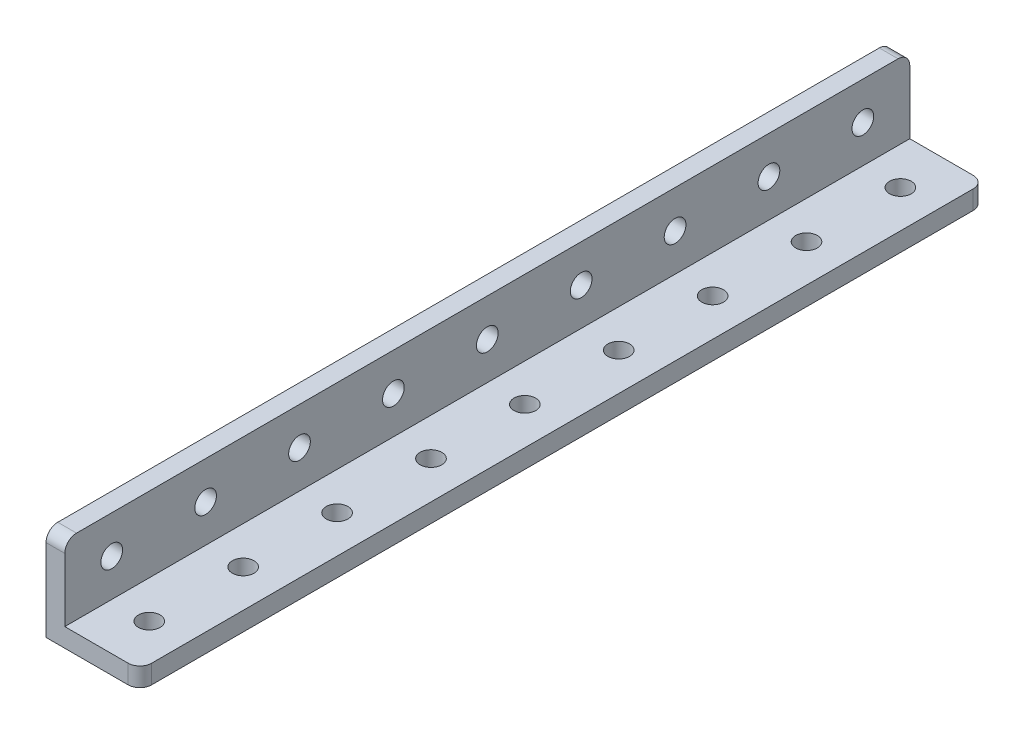
ISO-10303-21;
HEADER;
FILE_DESCRIPTION(('STEP AP214'),'2;1');
FILE_NAME('part.step','',(''),(''),'','','');
FILE_SCHEMA(('AUTOMOTIVE_DESIGN { 1 0 10303 214 1 1 1 1 }'));
ENDSEC;
DATA;
#1=APPLICATION_CONTEXT('core data for automotive mechanical design processes');
#2=APPLICATION_PROTOCOL_DEFINITION('international standard','automotive_design',2000,#1);
#3=PRODUCT_CONTEXT('',#1,'mechanical');
#4=PRODUCT('Part','Part','',(#3));
#5=PRODUCT_RELATED_PRODUCT_CATEGORY('part','',(#4));
#6=PRODUCT_DEFINITION_FORMATION('','',#4);
#7=PRODUCT_DEFINITION_CONTEXT('part definition',#1,'design');
#8=PRODUCT_DEFINITION('design','',#6,#7);
#9=PRODUCT_DEFINITION_SHAPE('','',#8);
#10=(LENGTH_UNIT() NAMED_UNIT(*) SI_UNIT(.MILLI.,.METRE.));
#11=(NAMED_UNIT(*) PLANE_ANGLE_UNIT() SI_UNIT($,.RADIAN.));
#12=(NAMED_UNIT(*) SI_UNIT($,.STERADIAN.) SOLID_ANGLE_UNIT());
#13=UNCERTAINTY_MEASURE_WITH_UNIT(LENGTH_MEASURE(1.E-05),#10,'distance_accuracy_value','');
#14=(GEOMETRIC_REPRESENTATION_CONTEXT(3) GLOBAL_UNCERTAINTY_ASSIGNED_CONTEXT((#13)) GLOBAL_UNIT_ASSIGNED_CONTEXT((#10,
#11,#12)) REPRESENTATION_CONTEXT('',''));
#15=CARTESIAN_POINT('',(0.,0.,0.));
#16=DIRECTION('',(0.,0.,1.));
#17=DIRECTION('',(1.,0.,0.));
#18=AXIS2_PLACEMENT_3D('',#15,#16,#17);
#19=CARTESIAN_POINT('',(14.,36.8576,-142.));
#20=DIRECTION('',(0.,-1.,0.));
#21=DIRECTION('',(0.,0.,-1.));
#22=AXIS2_PLACEMENT_3D('',#19,#20,#21);
#23=CYLINDRICAL_SURFACE('',#22,2.);
#24=CARTESIAN_POINT('',(14.,3.2,-142.));
#25=DIRECTION('',(0.,-1.,0.));
#26=DIRECTION('',(0.,0.,-1.));
#27=AXIS2_PLACEMENT_3D('',#24,#25,#26);
#28=CIRCLE('',#27,2.);
#29=CARTESIAN_POINT('',(16.,3.2,-142.));
#30=VERTEX_POINT('',#29);
#31=CARTESIAN_POINT('',(14.,3.2,-144.));
#32=VERTEX_POINT('',#31);
#33=EDGE_CURVE('E21',#30,#32,#28,.F.);
#34=ORIENTED_EDGE('',*,*,#33,.F.);
#35=DIRECTION('',(0.,1.,0.));
#36=VECTOR('',#35,1.);
#37=CARTESIAN_POINT('',(16.,0.,-142.));
#38=LINE('',#37,#36);
#39=CARTESIAN_POINT('',(16.,0.,-142.));
#40=VERTEX_POINT('',#39);
#41=EDGE_CURVE('E86',#40,#30,#38,.T.);
#42=ORIENTED_EDGE('',*,*,#41,.F.);
#43=CARTESIAN_POINT('',(14.,0.,-142.));
#44=DIRECTION('',(0.,-1.,0.));
#45=DIRECTION('',(0.,0.,-1.));
#46=AXIS2_PLACEMENT_3D('',#43,#44,#45);
#47=CIRCLE('',#46,2.);
#48=CARTESIAN_POINT('',(14.,0.,-144.));
#49=VERTEX_POINT('',#48);
#50=EDGE_CURVE('E227',#49,#40,#47,.T.);
#51=ORIENTED_EDGE('',*,*,#50,.F.);
#52=DIRECTION('',(0.,1.,0.));
#53=VECTOR('',#52,1.);
#54=CARTESIAN_POINT('',(14.,0.,-144.));
#55=LINE('',#54,#53);
#56=EDGE_CURVE('E89',#49,#32,#55,.T.);
#57=ORIENTED_EDGE('',*,*,#56,.T.);
#58=EDGE_LOOP('',(#34,#42,#51,#57));
#59=FACE_BOUND('',#58,.T.);
#60=ADVANCED_FACE('F18',(#59),#23,.T.);
#61=CARTESIAN_POINT('',(16.,0.,0.));
#62=DIRECTION('',(1.,0.,0.));
#63=DIRECTION('',(0.,0.,-1.));
#64=AXIS2_PLACEMENT_3D('',#61,#62,#63);
#65=PLANE('',#64);
#66=DIRECTION('',(0.,1.,0.));
#67=VECTOR('',#66,1.);
#68=CARTESIAN_POINT('',(16.,-20.8576,-2.));
#69=LINE('',#68,#67);
#70=CARTESIAN_POINT('',(16.,0.,-2.));
#71=VERTEX_POINT('',#70);
#72=CARTESIAN_POINT('',(16.,3.2,-2.));
#73=VERTEX_POINT('',#72);
#74=EDGE_CURVE('E95',#71,#73,#69,.T.);
#75=ORIENTED_EDGE('',*,*,#74,.F.);
#76=DIRECTION('',(0.,0.,-1.));
#77=VECTOR('',#76,1.);
#78=CARTESIAN_POINT('',(16.,0.,0.));
#79=LINE('',#78,#77);
#80=EDGE_CURVE('E102',#40,#71,#79,.F.);
#81=ORIENTED_EDGE('',*,*,#80,.F.);
#82=ORIENTED_EDGE('',*,*,#41,.T.);
#83=DIRECTION('',(0.,0.,1.));
#84=VECTOR('',#83,1.);
#85=CARTESIAN_POINT('',(16.,3.2,0.));
#86=LINE('',#85,#84);
#87=EDGE_CURVE('E99',#73,#30,#86,.F.);
#88=ORIENTED_EDGE('',*,*,#87,.F.);
#89=EDGE_LOOP('',(#75,#81,#82,#88));
#90=FACE_BOUND('',#89,.T.);
#91=ADVANCED_FACE('F98',(#90),#65,.T.);
#92=CARTESIAN_POINT('',(9.6,3.2,-8.));
#93=DIRECTION('',(0.,-1.,0.));
#94=DIRECTION('',(0.,0.,-1.));
#95=AXIS2_PLACEMENT_3D('',#92,#93,#94);
#96=CYLINDRICAL_SURFACE('',#95,1.85);
#97=CARTESIAN_POINT('',(9.6,3.2,-8.));
#98=DIRECTION('',(0.,-1.,0.));
#99=DIRECTION('',(0.,0.,-1.));
#100=AXIS2_PLACEMENT_3D('',#97,#98,#99);
#101=CIRCLE('',#100,1.85);
#102=CARTESIAN_POINT('',(9.6,3.2,-9.85));
#103=VERTEX_POINT('',#102);
#104=EDGE_CURVE('E107',#103,#103,#101,.T.);
#105=ORIENTED_EDGE('',*,*,#104,.F.);
#106=EDGE_LOOP('',(#105));
#107=FACE_BOUND('',#106,.T.);
#108=CARTESIAN_POINT('',(9.6,0.,-8.));
#109=DIRECTION('',(0.,-1.,0.));
#110=DIRECTION('',(0.,0.,-1.));
#111=AXIS2_PLACEMENT_3D('',#108,#109,#110);
#112=CIRCLE('',#111,1.85);
#113=CARTESIAN_POINT('',(9.6,0.,-9.85));
#114=VERTEX_POINT('',#113);
#115=EDGE_CURVE('E221',#114,#114,#112,.F.);
#116=ORIENTED_EDGE('',*,*,#115,.F.);
#117=EDGE_LOOP('',(#116));
#118=FACE_BOUND('',#117,.T.);
#119=ADVANCED_FACE('F262',(#107,#118),#96,.F.);
#120=CARTESIAN_POINT('',(9.6,3.2,-24.));
#121=DIRECTION('',(0.,-1.,0.));
#122=DIRECTION('',(0.,0.,-1.));
#123=AXIS2_PLACEMENT_3D('',#120,#121,#122);
#124=CYLINDRICAL_SURFACE('',#123,1.85);
#125=CARTESIAN_POINT('',(9.6,3.2,-24.));
#126=DIRECTION('',(0.,-1.,0.));
#127=DIRECTION('',(0.,0.,-1.));
#128=AXIS2_PLACEMENT_3D('',#125,#126,#127);
#129=CIRCLE('',#128,1.85);
#130=CARTESIAN_POINT('',(9.6,3.2,-25.85));
#131=VERTEX_POINT('',#130);
#132=EDGE_CURVE('E110',#131,#131,#129,.T.);
#133=ORIENTED_EDGE('',*,*,#132,.F.);
#134=EDGE_LOOP('',(#133));
#135=FACE_BOUND('',#134,.T.);
#136=CARTESIAN_POINT('',(9.6,0.,-24.));
#137=DIRECTION('',(0.,-1.,0.));
#138=DIRECTION('',(0.,0.,-1.));
#139=AXIS2_PLACEMENT_3D('',#136,#137,#138);
#140=CIRCLE('',#139,1.85);
#141=CARTESIAN_POINT('',(9.6,0.,-25.85));
#142=VERTEX_POINT('',#141);
#143=EDGE_CURVE('E218',#142,#142,#140,.F.);
#144=ORIENTED_EDGE('',*,*,#143,.F.);
#145=EDGE_LOOP('',(#144));
#146=FACE_BOUND('',#145,.T.);
#147=ADVANCED_FACE('F258',(#135,#146),#124,.F.);
#148=CARTESIAN_POINT('',(9.6,3.2,-40.));
#149=DIRECTION('',(0.,-1.,0.));
#150=DIRECTION('',(0.,0.,-1.));
#151=AXIS2_PLACEMENT_3D('',#148,#149,#150);
#152=CYLINDRICAL_SURFACE('',#151,1.85);
#153=CARTESIAN_POINT('',(9.6,3.2,-40.));
#154=DIRECTION('',(0.,-1.,0.));
#155=DIRECTION('',(0.,0.,-1.));
#156=AXIS2_PLACEMENT_3D('',#153,#154,#155);
#157=CIRCLE('',#156,1.85);
#158=CARTESIAN_POINT('',(9.6,3.2,-41.85));
#159=VERTEX_POINT('',#158);
#160=EDGE_CURVE('E250',#159,#159,#157,.T.);
#161=ORIENTED_EDGE('',*,*,#160,.F.);
#162=EDGE_LOOP('',(#161));
#163=FACE_BOUND('',#162,.T.);
#164=CARTESIAN_POINT('',(9.6,0.,-40.));
#165=DIRECTION('',(0.,-1.,0.));
#166=DIRECTION('',(0.,0.,-1.));
#167=AXIS2_PLACEMENT_3D('',#164,#165,#166);
#168=CIRCLE('',#167,1.85);
#169=CARTESIAN_POINT('',(9.6,0.,-41.85));
#170=VERTEX_POINT('',#169);
#171=EDGE_CURVE('E215',#170,#170,#168,.F.);
#172=ORIENTED_EDGE('',*,*,#171,.F.);
#173=EDGE_LOOP('',(#172));
#174=FACE_BOUND('',#173,.T.);
#175=ADVANCED_FACE('F261',(#163,#174),#152,.F.);
#176=CARTESIAN_POINT('',(9.6,3.2,-56.));
#177=DIRECTION('',(0.,-1.,0.));
#178=DIRECTION('',(0.,0.,-1.));
#179=AXIS2_PLACEMENT_3D('',#176,#177,#178);
#180=CYLINDRICAL_SURFACE('',#179,1.85);
#181=CARTESIAN_POINT('',(9.6,3.2,-56.));
#182=DIRECTION('',(0.,-1.,0.));
#183=DIRECTION('',(0.,0.,-1.));
#184=AXIS2_PLACEMENT_3D('',#181,#182,#183);
#185=CIRCLE('',#184,1.85);
#186=CARTESIAN_POINT('',(9.6,3.2,-57.85));
#187=VERTEX_POINT('',#186);
#188=EDGE_CURVE('E247',#187,#187,#185,.T.);
#189=ORIENTED_EDGE('',*,*,#188,.F.);
#190=EDGE_LOOP('',(#189));
#191=FACE_BOUND('',#190,.T.);
#192=CARTESIAN_POINT('',(9.6,0.,-56.));
#193=DIRECTION('',(0.,-1.,0.));
#194=DIRECTION('',(0.,0.,-1.));
#195=AXIS2_PLACEMENT_3D('',#192,#193,#194);
#196=CIRCLE('',#195,1.85);
#197=CARTESIAN_POINT('',(9.6,0.,-57.85));
#198=VERTEX_POINT('',#197);
#199=EDGE_CURVE('E212',#198,#198,#196,.F.);
#200=ORIENTED_EDGE('',*,*,#199,.F.);
#201=EDGE_LOOP('',(#200));
#202=FACE_BOUND('',#201,.T.);
#203=ADVANCED_FACE('F564',(#191,#202),#180,.F.);
#204=CARTESIAN_POINT('',(9.6,3.2,-72.));
#205=DIRECTION('',(0.,-1.,0.));
#206=DIRECTION('',(0.,0.,-1.));
#207=AXIS2_PLACEMENT_3D('',#204,#205,#206);
#208=CYLINDRICAL_SURFACE('',#207,1.85);
#209=CARTESIAN_POINT('',(9.6,3.2,-72.));
#210=DIRECTION('',(0.,-1.,0.));
#211=DIRECTION('',(0.,0.,-1.));
#212=AXIS2_PLACEMENT_3D('',#209,#210,#211);
#213=CIRCLE('',#212,1.85);
#214=CARTESIAN_POINT('',(9.6,3.2,-73.85));
#215=VERTEX_POINT('',#214);
#216=EDGE_CURVE('E244',#215,#215,#213,.T.);
#217=ORIENTED_EDGE('',*,*,#216,.F.);
#218=EDGE_LOOP('',(#217));
#219=FACE_BOUND('',#218,.T.);
#220=CARTESIAN_POINT('',(9.6,0.,-72.));
#221=DIRECTION('',(0.,-1.,0.));
#222=DIRECTION('',(0.,0.,-1.));
#223=AXIS2_PLACEMENT_3D('',#220,#221,#222);
#224=CIRCLE('',#223,1.85);
#225=CARTESIAN_POINT('',(9.6,0.,-73.85));
#226=VERTEX_POINT('',#225);
#227=EDGE_CURVE('E209',#226,#226,#224,.F.);
#228=ORIENTED_EDGE('',*,*,#227,.F.);
#229=EDGE_LOOP('',(#228));
#230=FACE_BOUND('',#229,.T.);
#231=ADVANCED_FACE('F555',(#219,#230),#208,.F.);
#232=CARTESIAN_POINT('',(9.6,3.2,-88.));
#233=DIRECTION('',(0.,-1.,0.));
#234=DIRECTION('',(0.,0.,-1.));
#235=AXIS2_PLACEMENT_3D('',#232,#233,#234);
#236=CYLINDRICAL_SURFACE('',#235,1.85);
#237=CARTESIAN_POINT('',(9.6,3.2,-88.));
#238=DIRECTION('',(0.,-1.,0.));
#239=DIRECTION('',(0.,0.,-1.));
#240=AXIS2_PLACEMENT_3D('',#237,#238,#239);
#241=CIRCLE('',#240,1.85);
#242=CARTESIAN_POINT('',(9.6,3.2,-89.85));
#243=VERTEX_POINT('',#242);
#244=EDGE_CURVE('E241',#243,#243,#241,.T.);
#245=ORIENTED_EDGE('',*,*,#244,.F.);
#246=EDGE_LOOP('',(#245));
#247=FACE_BOUND('',#246,.T.);
#248=CARTESIAN_POINT('',(9.6,0.,-88.));
#249=DIRECTION('',(0.,-1.,0.));
#250=DIRECTION('',(0.,0.,-1.));
#251=AXIS2_PLACEMENT_3D('',#248,#249,#250);
#252=CIRCLE('',#251,1.85);
#253=CARTESIAN_POINT('',(9.6,0.,-89.85));
#254=VERTEX_POINT('',#253);
#255=EDGE_CURVE('E206',#254,#254,#252,.F.);
#256=ORIENTED_EDGE('',*,*,#255,.F.);
#257=EDGE_LOOP('',(#256));
#258=FACE_BOUND('',#257,.T.);
#259=ADVANCED_FACE('F546',(#247,#258),#236,.F.);
#260=CARTESIAN_POINT('',(9.6,3.2,-104.));
#261=DIRECTION('',(0.,-1.,0.));
#262=DIRECTION('',(0.,0.,-1.));
#263=AXIS2_PLACEMENT_3D('',#260,#261,#262);
#264=CYLINDRICAL_SURFACE('',#263,1.85);
#265=CARTESIAN_POINT('',(9.6,3.2,-104.));
#266=DIRECTION('',(0.,-1.,0.));
#267=DIRECTION('',(0.,0.,-1.));
#268=AXIS2_PLACEMENT_3D('',#265,#266,#267);
#269=CIRCLE('',#268,1.85);
#270=CARTESIAN_POINT('',(9.6,3.2,-105.85));
#271=VERTEX_POINT('',#270);
#272=EDGE_CURVE('E238',#271,#271,#269,.T.);
#273=ORIENTED_EDGE('',*,*,#272,.F.);
#274=EDGE_LOOP('',(#273));
#275=FACE_BOUND('',#274,.T.);
#276=CARTESIAN_POINT('',(9.6,0.,-104.));
#277=DIRECTION('',(0.,-1.,0.));
#278=DIRECTION('',(0.,0.,-1.));
#279=AXIS2_PLACEMENT_3D('',#276,#277,#278);
#280=CIRCLE('',#279,1.85);
#281=CARTESIAN_POINT('',(9.6,0.,-105.85));
#282=VERTEX_POINT('',#281);
#283=EDGE_CURVE('E203',#282,#282,#280,.F.);
#284=ORIENTED_EDGE('',*,*,#283,.F.);
#285=EDGE_LOOP('',(#284));
#286=FACE_BOUND('',#285,.T.);
#287=ADVANCED_FACE('F537',(#275,#286),#264,.F.);
#288=CARTESIAN_POINT('',(9.6,3.2,-120.));
#289=DIRECTION('',(0.,-1.,0.));
#290=DIRECTION('',(0.,0.,-1.));
#291=AXIS2_PLACEMENT_3D('',#288,#289,#290);
#292=CYLINDRICAL_SURFACE('',#291,1.85);
#293=CARTESIAN_POINT('',(9.6,3.2,-120.));
#294=DIRECTION('',(0.,-1.,0.));
#295=DIRECTION('',(0.,0.,-1.));
#296=AXIS2_PLACEMENT_3D('',#293,#294,#295);
#297=CIRCLE('',#296,1.85);
#298=CARTESIAN_POINT('',(9.6,3.2,-121.85));
#299=VERTEX_POINT('',#298);
#300=EDGE_CURVE('E235',#299,#299,#297,.T.);
#301=ORIENTED_EDGE('',*,*,#300,.F.);
#302=EDGE_LOOP('',(#301));
#303=FACE_BOUND('',#302,.T.);
#304=CARTESIAN_POINT('',(9.6,0.,-120.));
#305=DIRECTION('',(0.,-1.,0.));
#306=DIRECTION('',(0.,0.,-1.));
#307=AXIS2_PLACEMENT_3D('',#304,#305,#306);
#308=CIRCLE('',#307,1.85);
#309=CARTESIAN_POINT('',(9.6,0.,-121.85));
#310=VERTEX_POINT('',#309);
#311=EDGE_CURVE('E200',#310,#310,#308,.F.);
#312=ORIENTED_EDGE('',*,*,#311,.F.);
#313=EDGE_LOOP('',(#312));
#314=FACE_BOUND('',#313,.T.);
#315=ADVANCED_FACE('F528',(#303,#314),#292,.F.);
#316=CARTESIAN_POINT('',(9.6,3.2,-136.));
#317=DIRECTION('',(0.,-1.,0.));
#318=DIRECTION('',(0.,0.,-1.));
#319=AXIS2_PLACEMENT_3D('',#316,#317,#318);
#320=CYLINDRICAL_SURFACE('',#319,1.85);
#321=CARTESIAN_POINT('',(9.6,3.2,-136.));
#322=DIRECTION('',(0.,-1.,0.));
#323=DIRECTION('',(0.,0.,-1.));
#324=AXIS2_PLACEMENT_3D('',#321,#322,#323);
#325=CIRCLE('',#324,1.85);
#326=CARTESIAN_POINT('',(9.6,3.2,-137.85));
#327=VERTEX_POINT('',#326);
#328=EDGE_CURVE('E232',#327,#327,#325,.T.);
#329=ORIENTED_EDGE('',*,*,#328,.F.);
#330=EDGE_LOOP('',(#329));
#331=FACE_BOUND('',#330,.T.);
#332=CARTESIAN_POINT('',(9.6,0.,-136.));
#333=DIRECTION('',(0.,-1.,0.));
#334=DIRECTION('',(0.,0.,-1.));
#335=AXIS2_PLACEMENT_3D('',#332,#333,#334);
#336=CIRCLE('',#335,1.85);
#337=CARTESIAN_POINT('',(9.6,0.,-137.85));
#338=VERTEX_POINT('',#337);
#339=EDGE_CURVE('E197',#338,#338,#336,.F.);
#340=ORIENTED_EDGE('',*,*,#339,.F.);
#341=EDGE_LOOP('',(#340));
#342=FACE_BOUND('',#341,.T.);
#343=ADVANCED_FACE('F519',(#331,#342),#320,.F.);
#344=CARTESIAN_POINT('',(14.,-20.8576,-2.));
#345=DIRECTION('',(0.,1.,0.));
#346=DIRECTION('',(0.,0.,1.));
#347=AXIS2_PLACEMENT_3D('',#344,#345,#346);
#348=CYLINDRICAL_SURFACE('',#347,2.);
#349=CARTESIAN_POINT('',(14.,0.,-2.));
#350=DIRECTION('',(0.,1.,0.));
#351=DIRECTION('',(0.,0.,1.));
#352=AXIS2_PLACEMENT_3D('',#349,#350,#351);
#353=CIRCLE('',#352,2.);
#354=CARTESIAN_POINT('',(14.,0.,0.));
#355=VERTEX_POINT('',#354);
#356=EDGE_CURVE('E225',#71,#355,#353,.F.);
#357=ORIENTED_EDGE('',*,*,#356,.F.);
#358=ORIENTED_EDGE('',*,*,#74,.T.);
#359=CARTESIAN_POINT('',(14.,3.2,-2.));
#360=DIRECTION('',(0.,1.,0.));
#361=DIRECTION('',(0.,0.,1.));
#362=AXIS2_PLACEMENT_3D('',#359,#360,#361);
#363=CIRCLE('',#362,2.);
#364=CARTESIAN_POINT('',(14.,3.2,0.));
#365=VERTEX_POINT('',#364);
#366=EDGE_CURVE('E94',#365,#73,#363,.T.);
#367=ORIENTED_EDGE('',*,*,#366,.F.);
#368=DIRECTION('',(0.,1.,0.));
#369=VECTOR('',#368,1.);
#370=CARTESIAN_POINT('',(14.,0.,0.));
#371=LINE('',#370,#369);
#372=EDGE_CURVE('E116',#355,#365,#371,.T.);
#373=ORIENTED_EDGE('',*,*,#372,.F.);
#374=EDGE_LOOP('',(#357,#358,#367,#373));
#375=FACE_BOUND('',#374,.T.);
#376=ADVANCED_FACE('F510',(#375),#348,.T.);
#377=CARTESIAN_POINT('',(16.,3.2,0.));
#378=DIRECTION('',(0.,1.,0.));
#379=DIRECTION('',(0.,0.,1.));
#380=AXIS2_PLACEMENT_3D('',#377,#378,#379);
#381=PLANE('',#380);
#382=ORIENTED_EDGE('',*,*,#328,.T.);
#383=EDGE_LOOP('',(#382));
#384=FACE_BOUND('',#383,.T.);
#385=ORIENTED_EDGE('',*,*,#300,.T.);
#386=EDGE_LOOP('',(#385));
#387=FACE_BOUND('',#386,.T.);
#388=ORIENTED_EDGE('',*,*,#272,.T.);
#389=EDGE_LOOP('',(#388));
#390=FACE_BOUND('',#389,.T.);
#391=ORIENTED_EDGE('',*,*,#244,.T.);
#392=EDGE_LOOP('',(#391));
#393=FACE_BOUND('',#392,.T.);
#394=ORIENTED_EDGE('',*,*,#216,.T.);
#395=EDGE_LOOP('',(#394));
#396=FACE_BOUND('',#395,.T.);
#397=ORIENTED_EDGE('',*,*,#188,.T.);
#398=EDGE_LOOP('',(#397));
#399=FACE_BOUND('',#398,.T.);
#400=ORIENTED_EDGE('',*,*,#160,.T.);
#401=EDGE_LOOP('',(#400));
#402=FACE_BOUND('',#401,.T.);
#403=ORIENTED_EDGE('',*,*,#132,.T.);
#404=EDGE_LOOP('',(#403));
#405=FACE_BOUND('',#404,.T.);
#406=ORIENTED_EDGE('',*,*,#104,.T.);
#407=EDGE_LOOP('',(#406));
#408=FACE_BOUND('',#407,.T.);
#409=ORIENTED_EDGE('',*,*,#366,.T.);
#410=ORIENTED_EDGE('',*,*,#87,.T.);
#411=ORIENTED_EDGE('',*,*,#33,.T.);
#412=DIRECTION('',(1.,0.,0.));
#413=VECTOR('',#412,1.);
#414=CARTESIAN_POINT('',(0.,3.2,-144.));
#415=LINE('',#414,#413);
#416=CARTESIAN_POINT('',(3.2,3.2,-144.));
#417=VERTEX_POINT('',#416);
#418=EDGE_CURVE('E122',#32,#417,#415,.F.);
#419=ORIENTED_EDGE('',*,*,#418,.T.);
#420=DIRECTION('',(0.,0.,-1.));
#421=VECTOR('',#420,1.);
#422=CARTESIAN_POINT('',(3.2,3.2,0.));
#423=LINE('',#422,#421);
#424=CARTESIAN_POINT('',(3.2,3.2,0.));
#425=VERTEX_POINT('',#424);
#426=EDGE_CURVE('E231',#425,#417,#423,.T.);
#427=ORIENTED_EDGE('',*,*,#426,.F.);
#428=DIRECTION('',(1.,0.,0.));
#429=VECTOR('',#428,1.);
#430=CARTESIAN_POINT('',(0.,3.2,0.));
#431=LINE('',#430,#429);
#432=EDGE_CURVE('E119',#365,#425,#431,.F.);
#433=ORIENTED_EDGE('',*,*,#432,.F.);
#434=EDGE_LOOP('',(#409,#410,#411,#419,#427,#433));
#435=FACE_BOUND('',#434,.T.);
#436=ADVANCED_FACE('F105',(#384,#387,#390,#393,#396,#399,#402,#405,#408,#435),#381,.T.);
#437=CARTESIAN_POINT('',(3.2,3.2,0.));
#438=DIRECTION('',(1.,0.,0.));
#439=DIRECTION('',(0.,0.,-1.));
#440=AXIS2_PLACEMENT_3D('',#437,#438,#439);
#441=PLANE('',#440);
#442=CARTESIAN_POINT('',(3.2,9.6,-136.));
#443=DIRECTION('',(-1.,0.,0.));
#444=DIRECTION('',(0.,0.,1.));
#445=AXIS2_PLACEMENT_3D('',#442,#443,#444);
#446=CIRCLE('',#445,1.85);
#447=CARTESIAN_POINT('',(3.2,9.6,-134.15));
#448=VERTEX_POINT('',#447);
#449=EDGE_CURVE('E165',#448,#448,#446,.T.);
#450=ORIENTED_EDGE('',*,*,#449,.T.);
#451=EDGE_LOOP('',(#450));
#452=FACE_BOUND('',#451,.T.);
#453=CARTESIAN_POINT('',(3.2,9.6,-120.));
#454=DIRECTION('',(-1.,0.,0.));
#455=DIRECTION('',(0.,0.,1.));
#456=AXIS2_PLACEMENT_3D('',#453,#454,#455);
#457=CIRCLE('',#456,1.85);
#458=CARTESIAN_POINT('',(3.2,9.6,-118.15));
#459=VERTEX_POINT('',#458);
#460=EDGE_CURVE('E168',#459,#459,#457,.T.);
#461=ORIENTED_EDGE('',*,*,#460,.T.);
#462=EDGE_LOOP('',(#461));
#463=FACE_BOUND('',#462,.T.);
#464=CARTESIAN_POINT('',(3.2,9.6,-104.));
#465=DIRECTION('',(-1.,0.,0.));
#466=DIRECTION('',(0.,0.,1.));
#467=AXIS2_PLACEMENT_3D('',#464,#465,#466);
#468=CIRCLE('',#467,1.85);
#469=CARTESIAN_POINT('',(3.2,9.6,-102.15));
#470=VERTEX_POINT('',#469);
#471=EDGE_CURVE('E171',#470,#470,#468,.T.);
#472=ORIENTED_EDGE('',*,*,#471,.T.);
#473=EDGE_LOOP('',(#472));
#474=FACE_BOUND('',#473,.T.);
#475=CARTESIAN_POINT('',(3.2,9.6,-88.));
#476=DIRECTION('',(-1.,0.,0.));
#477=DIRECTION('',(0.,0.,1.));
#478=AXIS2_PLACEMENT_3D('',#475,#476,#477);
#479=CIRCLE('',#478,1.85);
#480=CARTESIAN_POINT('',(3.2,9.6,-86.15));
#481=VERTEX_POINT('',#480);
#482=EDGE_CURVE('E174',#481,#481,#479,.T.);
#483=ORIENTED_EDGE('',*,*,#482,.T.);
#484=EDGE_LOOP('',(#483));
#485=FACE_BOUND('',#484,.T.);
#486=CARTESIAN_POINT('',(3.2,9.6,-72.));
#487=DIRECTION('',(-1.,0.,0.));
#488=DIRECTION('',(0.,0.,1.));
#489=AXIS2_PLACEMENT_3D('',#486,#487,#488);
#490=CIRCLE('',#489,1.85);
#491=CARTESIAN_POINT('',(3.2,9.6,-70.15));
#492=VERTEX_POINT('',#491);
#493=EDGE_CURVE('E177',#492,#492,#490,.T.);
#494=ORIENTED_EDGE('',*,*,#493,.T.);
#495=EDGE_LOOP('',(#494));
#496=FACE_BOUND('',#495,.T.);
#497=CARTESIAN_POINT('',(3.2,9.6,-56.));
#498=DIRECTION('',(-1.,0.,0.));
#499=DIRECTION('',(0.,0.,1.));
#500=AXIS2_PLACEMENT_3D('',#497,#498,#499);
#501=CIRCLE('',#500,1.85);
#502=CARTESIAN_POINT('',(3.2,9.6,-54.15));
#503=VERTEX_POINT('',#502);
#504=EDGE_CURVE('E180',#503,#503,#501,.T.);
#505=ORIENTED_EDGE('',*,*,#504,.T.);
#506=EDGE_LOOP('',(#505));
#507=FACE_BOUND('',#506,.T.);
#508=CARTESIAN_POINT('',(3.2,9.6,-40.));
#509=DIRECTION('',(-1.,0.,0.));
#510=DIRECTION('',(0.,0.,1.));
#511=AXIS2_PLACEMENT_3D('',#508,#509,#510);
#512=CIRCLE('',#511,1.85);
#513=CARTESIAN_POINT('',(3.2,9.6,-38.15));
#514=VERTEX_POINT('',#513);
#515=EDGE_CURVE('E183',#514,#514,#512,.T.);
#516=ORIENTED_EDGE('',*,*,#515,.T.);
#517=EDGE_LOOP('',(#516));
#518=FACE_BOUND('',#517,.T.);
#519=CARTESIAN_POINT('',(3.2,9.6,-24.));
#520=DIRECTION('',(-1.,0.,0.));
#521=DIRECTION('',(0.,0.,1.));
#522=AXIS2_PLACEMENT_3D('',#519,#520,#521);
#523=CIRCLE('',#522,1.85);
#524=CARTESIAN_POINT('',(3.2,9.6,-22.15));
#525=VERTEX_POINT('',#524);
#526=EDGE_CURVE('E186',#525,#525,#523,.T.);
#527=ORIENTED_EDGE('',*,*,#526,.T.);
#528=EDGE_LOOP('',(#527));
#529=FACE_BOUND('',#528,.T.);
#530=CARTESIAN_POINT('',(3.2,9.6,-8.));
#531=DIRECTION('',(-1.,0.,0.));
#532=DIRECTION('',(0.,0.,1.));
#533=AXIS2_PLACEMENT_3D('',#530,#531,#532);
#534=CIRCLE('',#533,1.85);
#535=CARTESIAN_POINT('',(3.2,9.6,-6.15));
#536=VERTEX_POINT('',#535);
#537=EDGE_CURVE('E189',#536,#536,#534,.T.);
#538=ORIENTED_EDGE('',*,*,#537,.T.);
#539=EDGE_LOOP('',(#538));
#540=FACE_BOUND('',#539,.T.);
#541=ORIENTED_EDGE('',*,*,#426,.T.);
#542=DIRECTION('',(0.,1.,0.));
#543=VECTOR('',#542,1.);
#544=CARTESIAN_POINT('',(3.2,0.,-144.));
#545=LINE('',#544,#543);
#546=CARTESIAN_POINT('',(3.2,14.,-144.));
#547=VERTEX_POINT('',#546);
#548=EDGE_CURVE('E125',#417,#547,#545,.T.);
#549=ORIENTED_EDGE('',*,*,#548,.T.);
#550=CARTESIAN_POINT('',(3.2,14.,-142.));
#551=DIRECTION('',(1.,0.,0.));
#552=DIRECTION('',(0.,0.,-1.));
#553=AXIS2_PLACEMENT_3D('',#550,#551,#552);
#554=CIRCLE('',#553,2.);
#555=CARTESIAN_POINT('',(3.2,16.,-142.));
#556=VERTEX_POINT('',#555);
#557=EDGE_CURVE('E123',#556,#547,#554,.F.);
#558=ORIENTED_EDGE('',*,*,#557,.F.);
#559=DIRECTION('',(0.,0.,1.));
#560=VECTOR('',#559,1.);
#561=CARTESIAN_POINT('',(3.2,16.,0.));
#562=LINE('',#561,#560);
#563=CARTESIAN_POINT('',(3.2,16.,-2.));
#564=VERTEX_POINT('',#563);
#565=EDGE_CURVE('E192',#564,#556,#562,.F.);
#566=ORIENTED_EDGE('',*,*,#565,.F.);
#567=CARTESIAN_POINT('',(3.2,14.,-2.));
#568=DIRECTION('',(-1.,0.,0.));
#569=DIRECTION('',(0.,0.,1.));
#570=AXIS2_PLACEMENT_3D('',#567,#568,#569);
#571=CIRCLE('',#570,2.);
#572=CARTESIAN_POINT('',(3.2,14.,0.));
#573=VERTEX_POINT('',#572);
#574=EDGE_CURVE('E193',#573,#564,#571,.T.);
#575=ORIENTED_EDGE('',*,*,#574,.F.);
#576=DIRECTION('',(0.,1.,0.));
#577=VECTOR('',#576,1.);
#578=CARTESIAN_POINT('',(3.2,0.,0.));
#579=LINE('',#578,#577);
#580=EDGE_CURVE('E305',#425,#573,#579,.T.);
#581=ORIENTED_EDGE('',*,*,#580,.F.);
#582=EDGE_LOOP('',(#541,#549,#558,#566,#575,#581));
#583=FACE_BOUND('',#582,.T.);
#584=ADVANCED_FACE('F332',(#452,#463,#474,#485,#496,#507,#518,#529,#540,#583),#441,.T.);
#585=CARTESIAN_POINT('',(-20.8576,14.,-142.));
#586=DIRECTION('',(1.,0.,0.));
#587=DIRECTION('',(0.,0.,-1.));
#588=AXIS2_PLACEMENT_3D('',#585,#586,#587);
#589=CYLINDRICAL_SURFACE('',#588,2.);
#590=CARTESIAN_POINT('',(0.,14.,-142.));
#591=DIRECTION('',(1.,0.,0.));
#592=DIRECTION('',(0.,0.,-1.));
#593=AXIS2_PLACEMENT_3D('',#590,#591,#592);
#594=CIRCLE('',#593,2.);
#595=CARTESIAN_POINT('',(0.,16.,-142.));
#596=VERTEX_POINT('',#595);
#597=CARTESIAN_POINT('',(0.,14.,-144.));
#598=VERTEX_POINT('',#597);
#599=EDGE_CURVE('E161',#596,#598,#594,.F.);
#600=ORIENTED_EDGE('',*,*,#599,.F.);
#601=DIRECTION('',(1.,0.,0.));
#602=VECTOR('',#601,1.);
#603=CARTESIAN_POINT('',(3.2,16.,-142.));
#604=LINE('',#603,#602);
#605=EDGE_CURVE('E195',#556,#596,#604,.F.);
#606=ORIENTED_EDGE('',*,*,#605,.F.);
#607=ORIENTED_EDGE('',*,*,#557,.T.);
#608=DIRECTION('',(1.,0.,0.));
#609=VECTOR('',#608,1.);
#610=CARTESIAN_POINT('',(0.,14.,-144.));
#611=LINE('',#610,#609);
#612=EDGE_CURVE('E127',#547,#598,#611,.F.);
#613=ORIENTED_EDGE('',*,*,#612,.T.);
#614=EDGE_LOOP('',(#600,#606,#607,#613));
#615=FACE_BOUND('',#614,.T.);
#616=ADVANCED_FACE('F341',(#615),#589,.T.);
#617=CARTESIAN_POINT('',(0.,0.,-144.));
#618=DIRECTION('',(0.,0.,1.));
#619=DIRECTION('',(1.,0.,0.));
#620=AXIS2_PLACEMENT_3D('',#617,#618,#619);
#621=PLANE('',#620);
#622=ORIENTED_EDGE('',*,*,#548,.F.);
#623=ORIENTED_EDGE('',*,*,#418,.F.);
#624=ORIENTED_EDGE('',*,*,#56,.F.);
#625=DIRECTION('',(1.,0.,0.));
#626=VECTOR('',#625,1.);
#627=CARTESIAN_POINT('',(0.,0.,-144.));
#628=LINE('',#627,#626);
#629=CARTESIAN_POINT('',(0.,0.,-144.));
#630=VERTEX_POINT('',#629);
#631=EDGE_CURVE('E224',#630,#49,#628,.T.);
#632=ORIENTED_EDGE('',*,*,#631,.F.);
#633=DIRECTION('',(0.,1.,0.));
#634=VECTOR('',#633,1.);
#635=CARTESIAN_POINT('',(0.,16.,-144.));
#636=LINE('',#635,#634);
#637=EDGE_CURVE('E164',#598,#630,#636,.F.);
#638=ORIENTED_EDGE('',*,*,#637,.F.);
#639=ORIENTED_EDGE('',*,*,#612,.F.);
#640=EDGE_LOOP('',(#622,#623,#624,#632,#638,#639));
#641=FACE_BOUND('',#640,.T.);
#642=ADVANCED_FACE('F270',(#641),#621,.F.);
#643=CARTESIAN_POINT('',(0.,0.,0.));
#644=DIRECTION('',(0.,-1.,0.));
#645=DIRECTION('',(0.,0.,-1.));
#646=AXIS2_PLACEMENT_3D('',#643,#644,#645);
#647=PLANE('',#646);
#648=ORIENTED_EDGE('',*,*,#339,.T.);
#649=EDGE_LOOP('',(#648));
#650=FACE_BOUND('',#649,.T.);
#651=ORIENTED_EDGE('',*,*,#311,.T.);
#652=EDGE_LOOP('',(#651));
#653=FACE_BOUND('',#652,.T.);
#654=ORIENTED_EDGE('',*,*,#283,.T.);
#655=EDGE_LOOP('',(#654));
#656=FACE_BOUND('',#655,.T.);
#657=ORIENTED_EDGE('',*,*,#255,.T.);
#658=EDGE_LOOP('',(#657));
#659=FACE_BOUND('',#658,.T.);
#660=ORIENTED_EDGE('',*,*,#227,.T.);
#661=EDGE_LOOP('',(#660));
#662=FACE_BOUND('',#661,.T.);
#663=ORIENTED_EDGE('',*,*,#199,.T.);
#664=EDGE_LOOP('',(#663));
#665=FACE_BOUND('',#664,.T.);
#666=ORIENTED_EDGE('',*,*,#171,.T.);
#667=EDGE_LOOP('',(#666));
#668=FACE_BOUND('',#667,.T.);
#669=ORIENTED_EDGE('',*,*,#143,.T.);
#670=EDGE_LOOP('',(#669));
#671=FACE_BOUND('',#670,.T.);
#672=ORIENTED_EDGE('',*,*,#115,.T.);
#673=EDGE_LOOP('',(#672));
#674=FACE_BOUND('',#673,.T.);
#675=DIRECTION('',(0.,0.,1.));
#676=VECTOR('',#675,1.);
#677=CARTESIAN_POINT('',(0.,0.,0.));
#678=LINE('',#677,#676);
#679=CARTESIAN_POINT('',(0.,0.,0.));
#680=VERTEX_POINT('',#679);
#681=EDGE_CURVE('E279',#630,#680,#678,.T.);
#682=ORIENTED_EDGE('',*,*,#681,.F.);
#683=ORIENTED_EDGE('',*,*,#631,.T.);
#684=ORIENTED_EDGE('',*,*,#50,.T.);
#685=ORIENTED_EDGE('',*,*,#80,.T.);
#686=ORIENTED_EDGE('',*,*,#356,.T.);
#687=DIRECTION('',(1.,0.,0.));
#688=VECTOR('',#687,1.);
#689=CARTESIAN_POINT('',(0.,0.,0.));
#690=LINE('',#689,#688);
#691=EDGE_CURVE('E120',#680,#355,#690,.T.);
#692=ORIENTED_EDGE('',*,*,#691,.F.);
#693=EDGE_LOOP('',(#682,#683,#684,#685,#686,#692));
#694=FACE_BOUND('',#693,.T.);
#695=ADVANCED_FACE('F266',(#650,#653,#656,#659,#662,#665,#668,#671,#674,#694),#647,.T.);
#696=CARTESIAN_POINT('',(0.,0.,0.));
#697=DIRECTION('',(0.,0.,1.));
#698=DIRECTION('',(1.,0.,0.));
#699=AXIS2_PLACEMENT_3D('',#696,#697,#698);
#700=PLANE('',#699);
#701=ORIENTED_EDGE('',*,*,#432,.T.);
#702=ORIENTED_EDGE('',*,*,#580,.T.);
#703=DIRECTION('',(-1.,0.,0.));
#704=VECTOR('',#703,1.);
#705=CARTESIAN_POINT('',(36.8576,14.,0.));
#706=LINE('',#705,#704);
#707=CARTESIAN_POINT('',(0.,14.,0.));
#708=VERTEX_POINT('',#707);
#709=EDGE_CURVE('E196',#708,#573,#706,.F.);
#710=ORIENTED_EDGE('',*,*,#709,.F.);
#711=DIRECTION('',(0.,1.,0.));
#712=VECTOR('',#711,1.);
#713=CARTESIAN_POINT('',(0.,16.,0.));
#714=LINE('',#713,#712);
#715=EDGE_CURVE('E160',#680,#708,#714,.T.);
#716=ORIENTED_EDGE('',*,*,#715,.F.);
#717=ORIENTED_EDGE('',*,*,#691,.T.);
#718=ORIENTED_EDGE('',*,*,#372,.T.);
#719=EDGE_LOOP('',(#701,#702,#710,#716,#717,#718));
#720=FACE_BOUND('',#719,.T.);
#721=ADVANCED_FACE('F269',(#720),#700,.T.);
#722=CARTESIAN_POINT('',(36.8576,14.,-2.));
#723=DIRECTION('',(-1.,0.,0.));
#724=DIRECTION('',(0.,0.,1.));
#725=AXIS2_PLACEMENT_3D('',#722,#723,#724);
#726=CYLINDRICAL_SURFACE('',#725,2.);
#727=ORIENTED_EDGE('',*,*,#574,.T.);
#728=DIRECTION('',(1.,0.,0.));
#729=VECTOR('',#728,1.);
#730=CARTESIAN_POINT('',(3.2,16.,-2.));
#731=LINE('',#730,#729);
#732=CARTESIAN_POINT('',(0.,16.,-2.));
#733=VERTEX_POINT('',#732);
#734=EDGE_CURVE('E36',#733,#564,#731,.T.);
#735=ORIENTED_EDGE('',*,*,#734,.F.);
#736=CARTESIAN_POINT('',(0.,14.,-2.));
#737=DIRECTION('',(-1.,0.,0.));
#738=DIRECTION('',(0.,0.,1.));
#739=AXIS2_PLACEMENT_3D('',#736,#737,#738);
#740=CIRCLE('',#739,2.);
#741=EDGE_CURVE('E157',#708,#733,#740,.T.);
#742=ORIENTED_EDGE('',*,*,#741,.F.);
#743=ORIENTED_EDGE('',*,*,#709,.T.);
#744=EDGE_LOOP('',(#727,#735,#742,#743));
#745=FACE_BOUND('',#744,.T.);
#746=ADVANCED_FACE('F334',(#745),#726,.T.);
#747=CARTESIAN_POINT('',(3.2,16.,0.));
#748=DIRECTION('',(0.,1.,0.));
#749=DIRECTION('',(0.,0.,1.));
#750=AXIS2_PLACEMENT_3D('',#747,#748,#749);
#751=PLANE('',#750);
#752=ORIENTED_EDGE('',*,*,#734,.T.);
#753=ORIENTED_EDGE('',*,*,#565,.T.);
#754=ORIENTED_EDGE('',*,*,#605,.T.);
#755=DIRECTION('',(0.,0.,1.));
#756=VECTOR('',#755,1.);
#757=CARTESIAN_POINT('',(0.,16.,0.));
#758=LINE('',#757,#756);
#759=EDGE_CURVE('E156',#733,#596,#758,.F.);
#760=ORIENTED_EDGE('',*,*,#759,.F.);
#761=EDGE_LOOP('',(#752,#753,#754,#760));
#762=FACE_BOUND('',#761,.T.);
#763=ADVANCED_FACE('F338',(#762),#751,.T.);
#764=CARTESIAN_POINT('',(3.2,9.6,-8.));
#765=DIRECTION('',(-1.,0.,0.));
#766=DIRECTION('',(0.,0.,1.));
#767=AXIS2_PLACEMENT_3D('',#764,#765,#766);
#768=CYLINDRICAL_SURFACE('',#767,1.85);
#769=ORIENTED_EDGE('',*,*,#537,.F.);
#770=EDGE_LOOP('',(#769));
#771=FACE_BOUND('',#770,.T.);
#772=CARTESIAN_POINT('',(0.,9.6,-8.));
#773=DIRECTION('',(-1.,0.,0.));
#774=DIRECTION('',(0.,0.,1.));
#775=AXIS2_PLACEMENT_3D('',#772,#773,#774);
#776=CIRCLE('',#775,1.85);
#777=CARTESIAN_POINT('',(0.,9.6,-6.15));
#778=VERTEX_POINT('',#777);
#779=EDGE_CURVE('E153',#778,#778,#776,.F.);
#780=ORIENTED_EDGE('',*,*,#779,.F.);
#781=EDGE_LOOP('',(#780));
#782=FACE_BOUND('',#781,.T.);
#783=ADVANCED_FACE('F388',(#771,#782),#768,.F.);
#784=CARTESIAN_POINT('',(3.2,9.6,-24.));
#785=DIRECTION('',(-1.,0.,0.));
#786=DIRECTION('',(0.,0.,1.));
#787=AXIS2_PLACEMENT_3D('',#784,#785,#786);
#788=CYLINDRICAL_SURFACE('',#787,1.85);
#789=ORIENTED_EDGE('',*,*,#526,.F.);
#790=EDGE_LOOP('',(#789));
#791=FACE_BOUND('',#790,.T.);
#792=CARTESIAN_POINT('',(0.,9.6,-24.));
#793=DIRECTION('',(-1.,0.,0.));
#794=DIRECTION('',(0.,0.,1.));
#795=AXIS2_PLACEMENT_3D('',#792,#793,#794);
#796=CIRCLE('',#795,1.85);
#797=CARTESIAN_POINT('',(0.,9.6,-22.15));
#798=VERTEX_POINT('',#797);
#799=EDGE_CURVE('E150',#798,#798,#796,.F.);
#800=ORIENTED_EDGE('',*,*,#799,.F.);
#801=EDGE_LOOP('',(#800));
#802=FACE_BOUND('',#801,.T.);
#803=ADVANCED_FACE('F384',(#791,#802),#788,.F.);
#804=CARTESIAN_POINT('',(3.2,9.6,-40.));
#805=DIRECTION('',(-1.,0.,0.));
#806=DIRECTION('',(0.,0.,1.));
#807=AXIS2_PLACEMENT_3D('',#804,#805,#806);
#808=CYLINDRICAL_SURFACE('',#807,1.85);
#809=ORIENTED_EDGE('',*,*,#515,.F.);
#810=EDGE_LOOP('',(#809));
#811=FACE_BOUND('',#810,.T.);
#812=CARTESIAN_POINT('',(0.,9.6,-40.));
#813=DIRECTION('',(-1.,0.,0.));
#814=DIRECTION('',(0.,0.,1.));
#815=AXIS2_PLACEMENT_3D('',#812,#813,#814);
#816=CIRCLE('',#815,1.85);
#817=CARTESIAN_POINT('',(0.,9.6,-38.15));
#818=VERTEX_POINT('',#817);
#819=EDGE_CURVE('E147',#818,#818,#816,.F.);
#820=ORIENTED_EDGE('',*,*,#819,.F.);
#821=EDGE_LOOP('',(#820));
#822=FACE_BOUND('',#821,.T.);
#823=ADVANCED_FACE('F380',(#811,#822),#808,.F.);
#824=CARTESIAN_POINT('',(3.2,9.6,-56.));
#825=DIRECTION('',(-1.,0.,0.));
#826=DIRECTION('',(0.,0.,1.));
#827=AXIS2_PLACEMENT_3D('',#824,#825,#826);
#828=CYLINDRICAL_SURFACE('',#827,1.85);
#829=ORIENTED_EDGE('',*,*,#504,.F.);
#830=EDGE_LOOP('',(#829));
#831=FACE_BOUND('',#830,.T.);
#832=CARTESIAN_POINT('',(0.,9.6,-56.));
#833=DIRECTION('',(-1.,0.,0.));
#834=DIRECTION('',(0.,0.,1.));
#835=AXIS2_PLACEMENT_3D('',#832,#833,#834);
#836=CIRCLE('',#835,1.85);
#837=CARTESIAN_POINT('',(0.,9.6,-54.15));
#838=VERTEX_POINT('',#837);
#839=EDGE_CURVE('E144',#838,#838,#836,.F.);
#840=ORIENTED_EDGE('',*,*,#839,.F.);
#841=EDGE_LOOP('',(#840));
#842=FACE_BOUND('',#841,.T.);
#843=ADVANCED_FACE('F376',(#831,#842),#828,.F.);
#844=CARTESIAN_POINT('',(3.2,9.6,-72.));
#845=DIRECTION('',(-1.,0.,0.));
#846=DIRECTION('',(0.,0.,1.));
#847=AXIS2_PLACEMENT_3D('',#844,#845,#846);
#848=CYLINDRICAL_SURFACE('',#847,1.85);
#849=ORIENTED_EDGE('',*,*,#493,.F.);
#850=EDGE_LOOP('',(#849));
#851=FACE_BOUND('',#850,.T.);
#852=CARTESIAN_POINT('',(0.,9.6,-72.));
#853=DIRECTION('',(-1.,0.,0.));
#854=DIRECTION('',(0.,0.,1.));
#855=AXIS2_PLACEMENT_3D('',#852,#853,#854);
#856=CIRCLE('',#855,1.85);
#857=CARTESIAN_POINT('',(0.,9.6,-70.15));
#858=VERTEX_POINT('',#857);
#859=EDGE_CURVE('E141',#858,#858,#856,.F.);
#860=ORIENTED_EDGE('',*,*,#859,.F.);
#861=EDGE_LOOP('',(#860));
#862=FACE_BOUND('',#861,.T.);
#863=ADVANCED_FACE('F372',(#851,#862),#848,.F.);
#864=CARTESIAN_POINT('',(3.2,9.6,-88.));
#865=DIRECTION('',(-1.,0.,0.));
#866=DIRECTION('',(0.,0.,1.));
#867=AXIS2_PLACEMENT_3D('',#864,#865,#866);
#868=CYLINDRICAL_SURFACE('',#867,1.85);
#869=ORIENTED_EDGE('',*,*,#482,.F.);
#870=EDGE_LOOP('',(#869));
#871=FACE_BOUND('',#870,.T.);
#872=CARTESIAN_POINT('',(0.,9.6,-88.));
#873=DIRECTION('',(-1.,0.,0.));
#874=DIRECTION('',(0.,0.,1.));
#875=AXIS2_PLACEMENT_3D('',#872,#873,#874);
#876=CIRCLE('',#875,1.85);
#877=CARTESIAN_POINT('',(0.,9.6,-86.15));
#878=VERTEX_POINT('',#877);
#879=EDGE_CURVE('E138',#878,#878,#876,.F.);
#880=ORIENTED_EDGE('',*,*,#879,.F.);
#881=EDGE_LOOP('',(#880));
#882=FACE_BOUND('',#881,.T.);
#883=ADVANCED_FACE('F368',(#871,#882),#868,.F.);
#884=CARTESIAN_POINT('',(3.2,9.6,-104.));
#885=DIRECTION('',(-1.,0.,0.));
#886=DIRECTION('',(0.,0.,1.));
#887=AXIS2_PLACEMENT_3D('',#884,#885,#886);
#888=CYLINDRICAL_SURFACE('',#887,1.85);
#889=ORIENTED_EDGE('',*,*,#471,.F.);
#890=EDGE_LOOP('',(#889));
#891=FACE_BOUND('',#890,.T.);
#892=CARTESIAN_POINT('',(0.,9.6,-104.));
#893=DIRECTION('',(-1.,0.,0.));
#894=DIRECTION('',(0.,0.,1.));
#895=AXIS2_PLACEMENT_3D('',#892,#893,#894);
#896=CIRCLE('',#895,1.85);
#897=CARTESIAN_POINT('',(0.,9.6,-102.15));
#898=VERTEX_POINT('',#897);
#899=EDGE_CURVE('E135',#898,#898,#896,.F.);
#900=ORIENTED_EDGE('',*,*,#899,.F.);
#901=EDGE_LOOP('',(#900));
#902=FACE_BOUND('',#901,.T.);
#903=ADVANCED_FACE('F364',(#891,#902),#888,.F.);
#904=CARTESIAN_POINT('',(3.2,9.6,-120.));
#905=DIRECTION('',(-1.,0.,0.));
#906=DIRECTION('',(0.,0.,1.));
#907=AXIS2_PLACEMENT_3D('',#904,#905,#906);
#908=CYLINDRICAL_SURFACE('',#907,1.85);
#909=ORIENTED_EDGE('',*,*,#460,.F.);
#910=EDGE_LOOP('',(#909));
#911=FACE_BOUND('',#910,.T.);
#912=CARTESIAN_POINT('',(0.,9.6,-120.));
#913=DIRECTION('',(-1.,0.,0.));
#914=DIRECTION('',(0.,0.,1.));
#915=AXIS2_PLACEMENT_3D('',#912,#913,#914);
#916=CIRCLE('',#915,1.85);
#917=CARTESIAN_POINT('',(0.,9.6,-118.15));
#918=VERTEX_POINT('',#917);
#919=EDGE_CURVE('E27',#918,#918,#916,.F.);
#920=ORIENTED_EDGE('',*,*,#919,.F.);
#921=EDGE_LOOP('',(#920));
#922=FACE_BOUND('',#921,.T.);
#923=ADVANCED_FACE('F357',(#911,#922),#908,.F.);
#924=CARTESIAN_POINT('',(3.2,9.6,-136.));
#925=DIRECTION('',(-1.,0.,0.));
#926=DIRECTION('',(0.,0.,1.));
#927=AXIS2_PLACEMENT_3D('',#924,#925,#926);
#928=CYLINDRICAL_SURFACE('',#927,1.85);
#929=ORIENTED_EDGE('',*,*,#449,.F.);
#930=EDGE_LOOP('',(#929));
#931=FACE_BOUND('',#930,.T.);
#932=CARTESIAN_POINT('',(0.,9.6,-136.));
#933=DIRECTION('',(-1.,0.,0.));
#934=DIRECTION('',(0.,0.,1.));
#935=AXIS2_PLACEMENT_3D('',#932,#933,#934);
#936=CIRCLE('',#935,1.85);
#937=CARTESIAN_POINT('',(0.,9.6,-134.15));
#938=VERTEX_POINT('',#937);
#939=EDGE_CURVE('E11',#938,#938,#936,.F.);
#940=ORIENTED_EDGE('',*,*,#939,.F.);
#941=EDGE_LOOP('',(#940));
#942=FACE_BOUND('',#941,.T.);
#943=ADVANCED_FACE('F351',(#931,#942),#928,.F.);
#944=CARTESIAN_POINT('',(0.,16.,0.));
#945=DIRECTION('',(-1.,0.,0.));
#946=DIRECTION('',(0.,0.,1.));
#947=AXIS2_PLACEMENT_3D('',#944,#945,#946);
#948=PLANE('',#947);
#949=ORIENTED_EDGE('',*,*,#939,.T.);
#950=EDGE_LOOP('',(#949));
#951=FACE_BOUND('',#950,.T.);
#952=ORIENTED_EDGE('',*,*,#919,.T.);
#953=EDGE_LOOP('',(#952));
#954=FACE_BOUND('',#953,.T.);
#955=ORIENTED_EDGE('',*,*,#899,.T.);
#956=EDGE_LOOP('',(#955));
#957=FACE_BOUND('',#956,.T.);
#958=ORIENTED_EDGE('',*,*,#879,.T.);
#959=EDGE_LOOP('',(#958));
#960=FACE_BOUND('',#959,.T.);
#961=ORIENTED_EDGE('',*,*,#859,.T.);
#962=EDGE_LOOP('',(#961));
#963=FACE_BOUND('',#962,.T.);
#964=ORIENTED_EDGE('',*,*,#839,.T.);
#965=EDGE_LOOP('',(#964));
#966=FACE_BOUND('',#965,.T.);
#967=ORIENTED_EDGE('',*,*,#819,.T.);
#968=EDGE_LOOP('',(#967));
#969=FACE_BOUND('',#968,.T.);
#970=ORIENTED_EDGE('',*,*,#799,.T.);
#971=EDGE_LOOP('',(#970));
#972=FACE_BOUND('',#971,.T.);
#973=ORIENTED_EDGE('',*,*,#779,.T.);
#974=EDGE_LOOP('',(#973));
#975=FACE_BOUND('',#974,.T.);
#976=ORIENTED_EDGE('',*,*,#741,.T.);
#977=ORIENTED_EDGE('',*,*,#759,.T.);
#978=ORIENTED_EDGE('',*,*,#599,.T.);
#979=ORIENTED_EDGE('',*,*,#637,.T.);
#980=ORIENTED_EDGE('',*,*,#681,.T.);
#981=ORIENTED_EDGE('',*,*,#715,.T.);
#982=EDGE_LOOP('',(#976,#977,#978,#979,#980,#981));
#983=FACE_BOUND('',#982,.T.);
#984=ADVANCED_FACE('F289',(#951,#954,#957,#960,#963,#966,#969,#972,#975,#983),#948,.T.);
#985=CLOSED_SHELL('',(#60,#91,#119,#147,#175,#203,#231,#259,#287,#315,#343,#376,#436,#584,#616,
#642,#695,#721,#746,#763,#783,#803,#823,#843,#863,#883,#903,#923,#943,#984));
#986=MANIFOLD_SOLID_BREP('B1',#985);
#987=ADVANCED_BREP_SHAPE_REPRESENTATION('',(#18,#986),#14);
#988=SHAPE_DEFINITION_REPRESENTATION(#9,#987);
ENDSEC;
END-ISO-10303-21;
